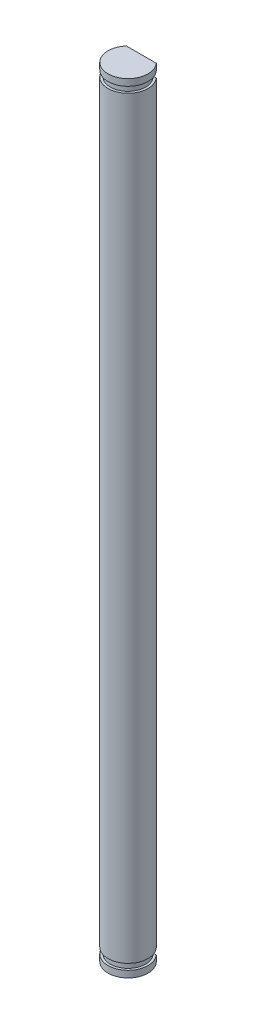
ISO-10303-21;
HEADER;
FILE_DESCRIPTION(('STEP AP214'),'2;1');
FILE_NAME('part.step','',(''),(''),'','','');
FILE_SCHEMA(('AUTOMOTIVE_DESIGN { 1 0 10303 214 1 1 1 1 }'));
ENDSEC;
DATA;
#1=APPLICATION_CONTEXT('core data for automotive mechanical design processes');
#2=APPLICATION_PROTOCOL_DEFINITION('international standard','automotive_design',2000,#1);
#3=PRODUCT_CONTEXT('',#1,'mechanical');
#4=PRODUCT('Part','Part','',(#3));
#5=PRODUCT_RELATED_PRODUCT_CATEGORY('part','',(#4));
#6=PRODUCT_DEFINITION_FORMATION('','',#4);
#7=PRODUCT_DEFINITION_CONTEXT('part definition',#1,'design');
#8=PRODUCT_DEFINITION('design','',#6,#7);
#9=PRODUCT_DEFINITION_SHAPE('','',#8);
#10=(LENGTH_UNIT() NAMED_UNIT(*) SI_UNIT(.MILLI.,.METRE.));
#11=(NAMED_UNIT(*) PLANE_ANGLE_UNIT() SI_UNIT($,.RADIAN.));
#12=(NAMED_UNIT(*) SI_UNIT($,.STERADIAN.) SOLID_ANGLE_UNIT());
#13=UNCERTAINTY_MEASURE_WITH_UNIT(LENGTH_MEASURE(1.E-05),#10,'distance_accuracy_value','');
#14=(GEOMETRIC_REPRESENTATION_CONTEXT(3) GLOBAL_UNCERTAINTY_ASSIGNED_CONTEXT((#13)) GLOBAL_UNIT_ASSIGNED_CONTEXT((#10,
#11,#12)) REPRESENTATION_CONTEXT('',''));
#15=CARTESIAN_POINT('',(0.,0.,0.));
#16=DIRECTION('',(0.,0.,1.));
#17=DIRECTION('',(1.,0.,0.));
#18=AXIS2_PLACEMENT_3D('',#15,#16,#17);
#19=CARTESIAN_POINT('',(0.,58.42,0.));
#20=DIRECTION('',(0.,-1.,0.));
#21=DIRECTION('',(0.,0.,-1.));
#22=AXIS2_PLACEMENT_3D('',#19,#20,#21);
#23=CYLINDRICAL_SURFACE('',#22,3.);
#24=CARTESIAN_POINT('',(0.,56.52,0.));
#25=DIRECTION('',(0.,1.,0.));
#26=DIRECTION('',(-1.,0.,0.));
#27=AXIS2_PLACEMENT_3D('',#24,#25,#26);
#28=CIRCLE('',#27,3.00000000000001);
#29=CARTESIAN_POINT('',(-2.2360679774998,56.52,-2.));
#30=VERTEX_POINT('',#29);
#31=CARTESIAN_POINT('',(2.2360679774998,56.52,-2.));
#32=VERTEX_POINT('',#31);
#33=EDGE_CURVE('E159',#30,#32,#28,.T.);
#34=ORIENTED_EDGE('',*,*,#33,.F.);
#35=DIRECTION('',(0.,-1.,0.));
#36=VECTOR('',#35,1.);
#37=CARTESIAN_POINT('',(-2.23606797749979,58.42,-2.));
#38=LINE('',#37,#36);
#39=CARTESIAN_POINT('',(-2.23606797749977,-56.52,-2.));
#40=VERTEX_POINT('',#39);
#41=EDGE_CURVE('E161',#30,#40,#38,.T.);
#42=ORIENTED_EDGE('',*,*,#41,.T.);
#43=CARTESIAN_POINT('',(0.,-56.52,0.));
#44=DIRECTION('',(0.,1.,0.));
#45=DIRECTION('',(-1.,0.,0.));
#46=AXIS2_PLACEMENT_3D('',#43,#44,#45);
#47=CIRCLE('',#46,2.99999999999999);
#48=CARTESIAN_POINT('',(2.23606797749979,-56.52,-2.));
#49=VERTEX_POINT('',#48);
#50=EDGE_CURVE('E116',#40,#49,#47,.T.);
#51=ORIENTED_EDGE('',*,*,#50,.T.);
#52=DIRECTION('',(0.,-1.,0.));
#53=VECTOR('',#52,1.);
#54=CARTESIAN_POINT('',(2.23606797749979,58.42,-2.));
#55=LINE('',#54,#53);
#56=EDGE_CURVE('E175',#32,#49,#55,.T.);
#57=ORIENTED_EDGE('',*,*,#56,.F.);
#58=EDGE_LOOP('',(#34,#42,#51,#57));
#59=FACE_BOUND('',#58,.T.);
#60=ADVANCED_FACE('F39',(#59),#23,.T.);
#61=CARTESIAN_POINT('',(0.,57.42,0.));
#62=DIRECTION('',(0.,1.,0.));
#63=DIRECTION('',(-1.,0.,0.));
#64=AXIS2_PLACEMENT_3D('',#61,#62,#63);
#65=CIRCLE('',#64,3.00000000000001);
#66=CARTESIAN_POINT('',(-2.2360679774998,57.42,-2.));
#67=VERTEX_POINT('',#66);
#68=CARTESIAN_POINT('',(2.2360679774998,57.42,-2.));
#69=VERTEX_POINT('',#68);
#70=EDGE_CURVE('E299',#67,#69,#65,.T.);
#71=ORIENTED_EDGE('',*,*,#70,.T.);
#72=CARTESIAN_POINT('',(2.23606797749979,58.42,-2.));
#73=VERTEX_POINT('',#72);
#74=EDGE_CURVE('E173',#73,#69,#55,.T.);
#75=ORIENTED_EDGE('',*,*,#74,.F.);
#76=CARTESIAN_POINT('',(0.,58.42,0.));
#77=DIRECTION('',(0.,1.,0.));
#78=DIRECTION('',(0.,0.,-1.));
#79=AXIS2_PLACEMENT_3D('',#76,#77,#78);
#80=CIRCLE('',#79,3.);
#81=CARTESIAN_POINT('',(-2.23606797749979,58.42,-2.));
#82=VERTEX_POINT('',#81);
#83=EDGE_CURVE('E189',#82,#73,#80,.T.);
#84=ORIENTED_EDGE('',*,*,#83,.F.);
#85=EDGE_CURVE('E163',#82,#67,#38,.T.);
#86=ORIENTED_EDGE('',*,*,#85,.T.);
#87=EDGE_LOOP('',(#71,#75,#84,#86));
#88=FACE_BOUND('',#87,.T.);
#89=ADVANCED_FACE('F210',(#88),#23,.T.);
#90=CARTESIAN_POINT('',(0.,-57.42,0.));
#91=DIRECTION('',(0.,1.,0.));
#92=DIRECTION('',(-1.,0.,0.));
#93=AXIS2_PLACEMENT_3D('',#90,#91,#92);
#94=CIRCLE('',#93,2.99999999999999);
#95=CARTESIAN_POINT('',(-2.23606797749977,-57.42,-2.));
#96=VERTEX_POINT('',#95);
#97=CARTESIAN_POINT('',(2.23606797749979,-57.42,-2.));
#98=VERTEX_POINT('',#97);
#99=EDGE_CURVE('E181',#96,#98,#94,.T.);
#100=ORIENTED_EDGE('',*,*,#99,.F.);
#101=CARTESIAN_POINT('',(-2.23606797749979,-58.42,-2.));
#102=VERTEX_POINT('',#101);
#103=EDGE_CURVE('E164',#96,#102,#38,.T.);
#104=ORIENTED_EDGE('',*,*,#103,.T.);
#105=CARTESIAN_POINT('',(0.,-58.42,0.));
#106=DIRECTION('',(0.,1.,0.));
#107=DIRECTION('',(0.,0.,-1.));
#108=AXIS2_PLACEMENT_3D('',#105,#106,#107);
#109=CIRCLE('',#108,3.);
#110=CARTESIAN_POINT('',(2.23606797749979,-58.42,-2.));
#111=VERTEX_POINT('',#110);
#112=EDGE_CURVE('E158',#102,#111,#109,.T.);
#113=ORIENTED_EDGE('',*,*,#112,.T.);
#114=EDGE_CURVE('E167',#98,#111,#55,.T.);
#115=ORIENTED_EDGE('',*,*,#114,.F.);
#116=EDGE_LOOP('',(#100,#104,#113,#115));
#117=FACE_BOUND('',#116,.T.);
#118=ADVANCED_FACE('F211',(#117),#23,.T.);
#119=CARTESIAN_POINT('',(-2.23606797749979,58.42,-2.));
#120=DIRECTION('',(0.,0.,1.));
#121=DIRECTION('',(1.,0.,0.));
#122=AXIS2_PLACEMENT_3D('',#119,#120,#121);
#123=PLANE('',#122);
#124=DIRECTION('',(-1.,0.,0.));
#125=VECTOR('',#124,1.);
#126=CARTESIAN_POINT('',(-2.23606797749979,56.52,-2.));
#127=LINE('',#126,#125);
#128=CARTESIAN_POINT('',(-1.73853386507141,56.52,-2.));
#129=VERTEX_POINT('',#128);
#130=EDGE_CURVE('E11',#129,#30,#127,.T.);
#131=ORIENTED_EDGE('',*,*,#130,.F.);
#132=DIRECTION('',(0.,1.,0.));
#133=VECTOR('',#132,1.);
#134=CARTESIAN_POINT('',(-1.73853386507139,48.0561399502223,-2.));
#135=LINE('',#134,#133);
#136=CARTESIAN_POINT('',(-1.73853386507138,57.42,-2.));
#137=VERTEX_POINT('',#136);
#138=EDGE_CURVE('E42',#137,#129,#135,.F.);
#139=ORIENTED_EDGE('',*,*,#138,.F.);
#140=DIRECTION('',(1.,0.,0.));
#141=VECTOR('',#140,1.);
#142=CARTESIAN_POINT('',(-2.23606797749979,57.42,-2.));
#143=LINE('',#142,#141);
#144=EDGE_CURVE('E145',#67,#137,#143,.T.);
#145=ORIENTED_EDGE('',*,*,#144,.F.);
#146=ORIENTED_EDGE('',*,*,#85,.F.);
#147=DIRECTION('',(-1.,0.,0.));
#148=VECTOR('',#147,1.);
#149=CARTESIAN_POINT('',(-2.23606797749979,58.42,-2.));
#150=LINE('',#149,#148);
#151=EDGE_CURVE('E168',#73,#82,#150,.T.);
#152=ORIENTED_EDGE('',*,*,#151,.F.);
#153=ORIENTED_EDGE('',*,*,#74,.T.);
#154=CARTESIAN_POINT('',(1.73853386507138,57.42,-2.));
#155=VERTEX_POINT('',#154);
#156=EDGE_CURVE('E139',#155,#69,#143,.T.);
#157=ORIENTED_EDGE('',*,*,#156,.F.);
#158=DIRECTION('',(0.,1.,0.));
#159=VECTOR('',#158,1.);
#160=CARTESIAN_POINT('',(1.73853386507139,48.0561399502223,-2.));
#161=LINE('',#160,#159);
#162=CARTESIAN_POINT('',(1.7385338650714,56.52,-2.));
#163=VERTEX_POINT('',#162);
#164=EDGE_CURVE('E144',#163,#155,#161,.T.);
#165=ORIENTED_EDGE('',*,*,#164,.F.);
#166=EDGE_CURVE('E47',#32,#163,#127,.T.);
#167=ORIENTED_EDGE('',*,*,#166,.F.);
#168=ORIENTED_EDGE('',*,*,#56,.T.);
#169=DIRECTION('',(1.,0.,0.));
#170=VECTOR('',#169,1.);
#171=CARTESIAN_POINT('',(-2.23606797749978,-56.52,-2.));
#172=LINE('',#171,#170);
#173=CARTESIAN_POINT('',(1.7385338650714,-56.52,-2.));
#174=VERTEX_POINT('',#173);
#175=EDGE_CURVE('E124',#174,#49,#172,.T.);
#176=ORIENTED_EDGE('',*,*,#175,.F.);
#177=DIRECTION('',(0.,1.,0.));
#178=VECTOR('',#177,1.);
#179=CARTESIAN_POINT('',(1.73853386507137,48.0561399502223,-2.));
#180=LINE('',#179,#178);
#181=CARTESIAN_POINT('',(1.73853386507137,-57.42,-2.));
#182=VERTEX_POINT('',#181);
#183=EDGE_CURVE('E130',#182,#174,#180,.T.);
#184=ORIENTED_EDGE('',*,*,#183,.F.);
#185=DIRECTION('',(-1.,0.,0.));
#186=VECTOR('',#185,1.);
#187=CARTESIAN_POINT('',(-2.23606797749978,-57.42,-2.));
#188=LINE('',#187,#186);
#189=EDGE_CURVE('E122',#98,#182,#188,.T.);
#190=ORIENTED_EDGE('',*,*,#189,.F.);
#191=ORIENTED_EDGE('',*,*,#114,.T.);
#192=DIRECTION('',(-1.,0.,0.));
#193=VECTOR('',#192,1.);
#194=CARTESIAN_POINT('',(-2.23606797749979,-58.42,-2.));
#195=LINE('',#194,#193);
#196=EDGE_CURVE('E171',#111,#102,#195,.T.);
#197=ORIENTED_EDGE('',*,*,#196,.T.);
#198=ORIENTED_EDGE('',*,*,#103,.F.);
#199=CARTESIAN_POINT('',(-1.73853386507135,-57.42,-2.));
#200=VERTEX_POINT('',#199);
#201=EDGE_CURVE('E137',#200,#96,#188,.T.);
#202=ORIENTED_EDGE('',*,*,#201,.F.);
#203=DIRECTION('',(0.,1.,0.));
#204=VECTOR('',#203,1.);
#205=CARTESIAN_POINT('',(-1.73853386507137,48.0561399502223,-2.));
#206=LINE('',#205,#204);
#207=CARTESIAN_POINT('',(-1.73853386507137,-56.52,-2.));
#208=VERTEX_POINT('',#207);
#209=EDGE_CURVE('E121',#208,#200,#206,.F.);
#210=ORIENTED_EDGE('',*,*,#209,.F.);
#211=EDGE_CURVE('E113',#40,#208,#172,.T.);
#212=ORIENTED_EDGE('',*,*,#211,.F.);
#213=ORIENTED_EDGE('',*,*,#41,.F.);
#214=EDGE_LOOP('',(#131,#139,#145,#146,#152,#153,#157,#165,#167,#168,#176,#184,#190,#191,#197,
#198,#202,#210,#212,#213));
#215=FACE_BOUND('',#214,.T.);
#216=ADVANCED_FACE('F135',(#215),#123,.F.);
#217=CARTESIAN_POINT('',(0.,58.42,0.));
#218=DIRECTION('',(0.,-1.,0.));
#219=DIRECTION('',(0.,0.,-1.));
#220=AXIS2_PLACEMENT_3D('',#217,#218,#219);
#221=PLANE('',#220);
#222=ORIENTED_EDGE('',*,*,#83,.T.);
#223=ORIENTED_EDGE('',*,*,#151,.T.);
#224=EDGE_LOOP('',(#222,#223));
#225=FACE_BOUND('',#224,.T.);
#226=ADVANCED_FACE('F200',(#225),#221,.F.);
#227=CARTESIAN_POINT('',(0.,-58.42,0.));
#228=DIRECTION('',(0.,-1.,0.));
#229=DIRECTION('',(0.,0.,-1.));
#230=AXIS2_PLACEMENT_3D('',#227,#228,#229);
#231=PLANE('',#230);
#232=ORIENTED_EDGE('',*,*,#112,.F.);
#233=ORIENTED_EDGE('',*,*,#196,.F.);
#234=EDGE_LOOP('',(#232,#233));
#235=FACE_BOUND('',#234,.T.);
#236=ADVANCED_FACE('F198',(#235),#231,.T.);
#237=CARTESIAN_POINT('',(0.,48.0561399502223,0.));
#238=DIRECTION('',(0.,1.,0.));
#239=DIRECTION('',(-1.,0.,0.));
#240=AXIS2_PLACEMENT_3D('',#237,#238,#239);
#241=CYLINDRICAL_SURFACE('',#240,2.65);
#242=ORIENTED_EDGE('',*,*,#183,.T.);
#243=CARTESIAN_POINT('',(0.,-56.52,0.));
#244=DIRECTION('',(0.,1.,0.));
#245=DIRECTION('',(-1.,0.,0.));
#246=AXIS2_PLACEMENT_3D('',#243,#244,#245);
#247=CIRCLE('',#246,2.65000000000001);
#248=EDGE_CURVE('E62',#208,#174,#247,.T.);
#249=ORIENTED_EDGE('',*,*,#248,.F.);
#250=ORIENTED_EDGE('',*,*,#209,.T.);
#251=CARTESIAN_POINT('',(0.,-57.42,0.));
#252=DIRECTION('',(0.,1.,0.));
#253=DIRECTION('',(-1.,0.,0.));
#254=AXIS2_PLACEMENT_3D('',#251,#252,#253);
#255=CIRCLE('',#254,2.64999999999999);
#256=EDGE_CURVE('E179',#200,#182,#255,.T.);
#257=ORIENTED_EDGE('',*,*,#256,.T.);
#258=EDGE_LOOP('',(#242,#249,#250,#257));
#259=FACE_BOUND('',#258,.T.);
#260=ADVANCED_FACE('F126',(#259),#241,.T.);
#261=CARTESIAN_POINT('',(2.65000000000001,-57.42,0.));
#262=DIRECTION('',(0.,1.,0.));
#263=DIRECTION('',(-1.,0.,0.));
#264=AXIS2_PLACEMENT_3D('',#261,#262,#263);
#265=PLANE('',#264);
#266=ORIENTED_EDGE('',*,*,#189,.T.);
#267=ORIENTED_EDGE('',*,*,#256,.F.);
#268=ORIENTED_EDGE('',*,*,#201,.T.);
#269=ORIENTED_EDGE('',*,*,#99,.T.);
#270=EDGE_LOOP('',(#266,#267,#268,#269));
#271=FACE_BOUND('',#270,.T.);
#272=ADVANCED_FACE('F178',(#271),#265,.T.);
#273=CARTESIAN_POINT('',(2.65000000000002,-56.52,0.));
#274=DIRECTION('',(0.,-1.,0.));
#275=DIRECTION('',(1.,0.,0.));
#276=AXIS2_PLACEMENT_3D('',#273,#274,#275);
#277=PLANE('',#276);
#278=ORIENTED_EDGE('',*,*,#211,.T.);
#279=ORIENTED_EDGE('',*,*,#248,.T.);
#280=ORIENTED_EDGE('',*,*,#175,.T.);
#281=ORIENTED_EDGE('',*,*,#50,.F.);
#282=EDGE_LOOP('',(#278,#279,#280,#281));
#283=FACE_BOUND('',#282,.T.);
#284=ADVANCED_FACE('F114',(#283),#277,.T.);
#285=CARTESIAN_POINT('',(0.,48.0561399502223,0.));
#286=DIRECTION('',(0.,1.,0.));
#287=DIRECTION('',(-1.,0.,0.));
#288=AXIS2_PLACEMENT_3D('',#285,#286,#287);
#289=CYLINDRICAL_SURFACE('',#288,2.65000000000002);
#290=ORIENTED_EDGE('',*,*,#164,.T.);
#291=CARTESIAN_POINT('',(0.,57.42,0.));
#292=DIRECTION('',(0.,1.,0.));
#293=DIRECTION('',(-1.,0.,0.));
#294=AXIS2_PLACEMENT_3D('',#291,#292,#293);
#295=CIRCLE('',#294,2.65000000000001);
#296=EDGE_CURVE('E54',#137,#155,#295,.T.);
#297=ORIENTED_EDGE('',*,*,#296,.F.);
#298=ORIENTED_EDGE('',*,*,#138,.T.);
#299=CARTESIAN_POINT('',(0.,56.52,0.));
#300=DIRECTION('',(0.,1.,0.));
#301=DIRECTION('',(-1.,0.,0.));
#302=AXIS2_PLACEMENT_3D('',#299,#300,#301);
#303=CIRCLE('',#302,2.65000000000002);
#304=EDGE_CURVE('E154',#129,#163,#303,.T.);
#305=ORIENTED_EDGE('',*,*,#304,.T.);
#306=EDGE_LOOP('',(#290,#297,#298,#305));
#307=FACE_BOUND('',#306,.T.);
#308=ADVANCED_FACE('F153',(#307),#289,.T.);
#309=CARTESIAN_POINT('',(2.65000000000002,56.52,0.));
#310=DIRECTION('',(0.,1.,0.));
#311=DIRECTION('',(-1.,0.,0.));
#312=AXIS2_PLACEMENT_3D('',#309,#310,#311);
#313=PLANE('',#312);
#314=ORIENTED_EDGE('',*,*,#166,.T.);
#315=ORIENTED_EDGE('',*,*,#304,.F.);
#316=ORIENTED_EDGE('',*,*,#130,.T.);
#317=ORIENTED_EDGE('',*,*,#33,.T.);
#318=EDGE_LOOP('',(#314,#315,#316,#317));
#319=FACE_BOUND('',#318,.T.);
#320=ADVANCED_FACE('F156',(#319),#313,.T.);
#321=CARTESIAN_POINT('',(2.65000000000001,57.42,0.));
#322=DIRECTION('',(0.,-1.,0.));
#323=DIRECTION('',(1.,0.,0.));
#324=AXIS2_PLACEMENT_3D('',#321,#322,#323);
#325=PLANE('',#324);
#326=ORIENTED_EDGE('',*,*,#144,.T.);
#327=ORIENTED_EDGE('',*,*,#296,.T.);
#328=ORIENTED_EDGE('',*,*,#156,.T.);
#329=ORIENTED_EDGE('',*,*,#70,.F.);
#330=EDGE_LOOP('',(#326,#327,#328,#329));
#331=FACE_BOUND('',#330,.T.);
#332=ADVANCED_FACE('F256',(#331),#325,.T.);
#333=CLOSED_SHELL('',(#60,#89,#118,#216,#226,#236,#260,#272,#284,#308,#320,#332));
#334=MANIFOLD_SOLID_BREP('B2',#333);
#335=ADVANCED_BREP_SHAPE_REPRESENTATION('',(#18,#334),#14);
#336=SHAPE_DEFINITION_REPRESENTATION(#9,#335);
ENDSEC;
END-ISO-10303-21;
